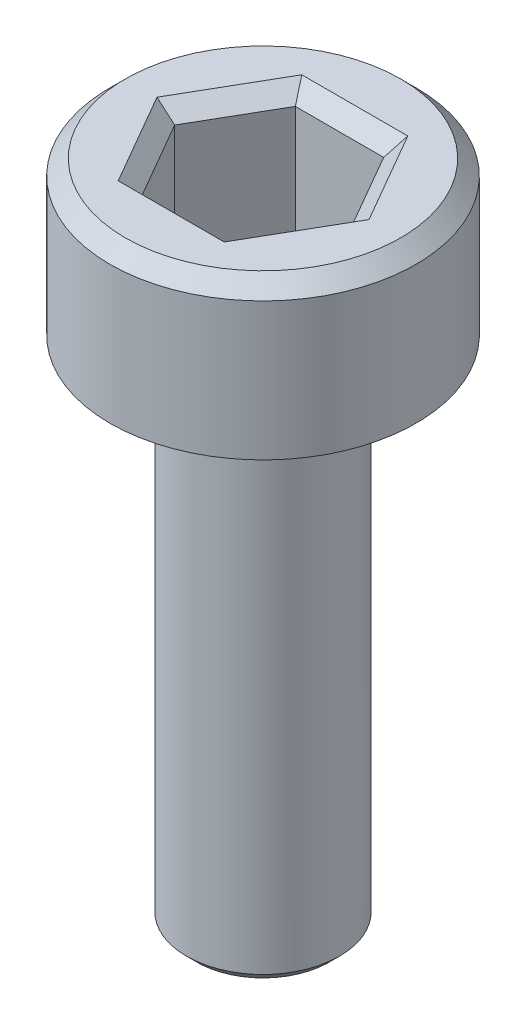
ISO-10303-21;
HEADER;
FILE_DESCRIPTION(('STEP AP214'),'2;1');
FILE_NAME('part.step','',(''),(''),'','','');
FILE_SCHEMA(('AUTOMOTIVE_DESIGN { 1 0 10303 214 1 1 1 1 }'));
ENDSEC;
DATA;
#1=APPLICATION_CONTEXT('core data for automotive mechanical design processes');
#2=APPLICATION_PROTOCOL_DEFINITION('international standard','automotive_design',2000,#1);
#3=PRODUCT_CONTEXT('',#1,'mechanical');
#4=PRODUCT('Part','Part','',(#3));
#5=PRODUCT_RELATED_PRODUCT_CATEGORY('part','',(#4));
#6=PRODUCT_DEFINITION_FORMATION('','',#4);
#7=PRODUCT_DEFINITION_CONTEXT('part definition',#1,'design');
#8=PRODUCT_DEFINITION('design','',#6,#7);
#9=PRODUCT_DEFINITION_SHAPE('','',#8);
#10=(LENGTH_UNIT() NAMED_UNIT(*) SI_UNIT(.MILLI.,.METRE.));
#11=(NAMED_UNIT(*) PLANE_ANGLE_UNIT() SI_UNIT($,.RADIAN.));
#12=(NAMED_UNIT(*) SI_UNIT($,.STERADIAN.) SOLID_ANGLE_UNIT());
#13=UNCERTAINTY_MEASURE_WITH_UNIT(LENGTH_MEASURE(1.E-05),#10,'distance_accuracy_value','');
#14=(GEOMETRIC_REPRESENTATION_CONTEXT(3) GLOBAL_UNCERTAINTY_ASSIGNED_CONTEXT((#13)) GLOBAL_UNIT_ASSIGNED_CONTEXT((#10,
#11,#12)) REPRESENTATION_CONTEXT('',''));
#15=CARTESIAN_POINT('',(0.,0.,0.));
#16=DIRECTION('',(0.,0.,1.));
#17=DIRECTION('',(1.,0.,0.));
#18=AXIS2_PLACEMENT_3D('',#15,#16,#17);
#19=CARTESIAN_POINT('',(0.,0.,0.));
#20=DIRECTION('',(0.,1.,0.));
#21=DIRECTION('',(0.,0.,1.));
#22=AXIS2_PLACEMENT_3D('',#19,#20,#21);
#23=PLANE('',#22);
#24=CARTESIAN_POINT('',(0.,0.,0.));
#25=DIRECTION('',(0.,1.,0.));
#26=DIRECTION('',(0.,0.,1.));
#27=AXIS2_PLACEMENT_3D('',#24,#25,#26);
#28=CIRCLE('',#27,3.);
#29=CARTESIAN_POINT('',(0.,0.,3.));
#30=VERTEX_POINT('',#29);
#31=EDGE_CURVE('E146',#30,#30,#28,.T.);
#32=ORIENTED_EDGE('',*,*,#31,.F.);
#33=EDGE_LOOP('',(#32));
#34=FACE_BOUND('',#33,.T.);
#35=CARTESIAN_POINT('',(0.,0.,0.));
#36=DIRECTION('',(0.,1.,0.));
#37=DIRECTION('',(0.,0.,1.));
#38=AXIS2_PLACEMENT_3D('',#35,#36,#37);
#39=CIRCLE('',#38,1.5);
#40=CARTESIAN_POINT('',(0.,0.,1.5));
#41=VERTEX_POINT('',#40);
#42=EDGE_CURVE('E185',#41,#41,#39,.F.);
#43=ORIENTED_EDGE('',*,*,#42,.F.);
#44=EDGE_LOOP('',(#43));
#45=FACE_BOUND('',#44,.T.);
#46=ADVANCED_FACE('F33',(#34,#45),#23,.F.);
#47=CARTESIAN_POINT('',(0.,3.,0.));
#48=DIRECTION('',(0.,-1.,0.));
#49=DIRECTION('',(0.,0.,-1.));
#50=AXIS2_PLACEMENT_3D('',#47,#48,#49);
#51=CYLINDRICAL_SURFACE('',#50,3.);
#52=CARTESIAN_POINT('',(0.,2.7,0.));
#53=DIRECTION('',(0.,1.,0.));
#54=DIRECTION('',(0.,0.,1.));
#55=AXIS2_PLACEMENT_3D('',#52,#53,#54);
#56=CIRCLE('',#55,3.);
#57=CARTESIAN_POINT('',(0.,2.7,3.));
#58=VERTEX_POINT('',#57);
#59=EDGE_CURVE('E160',#58,#58,#56,.F.);
#60=ORIENTED_EDGE('',*,*,#59,.T.);
#61=EDGE_LOOP('',(#60));
#62=FACE_BOUND('',#61,.T.);
#63=ORIENTED_EDGE('',*,*,#31,.T.);
#64=EDGE_LOOP('',(#63));
#65=FACE_BOUND('',#64,.T.);
#66=ADVANCED_FACE('F213',(#62,#65),#51,.T.);
#67=CARTESIAN_POINT('',(0.,3.,0.));
#68=DIRECTION('',(0.,1.,0.));
#69=DIRECTION('',(0.,0.,1.));
#70=AXIS2_PLACEMENT_3D('',#67,#68,#69);
#71=PLANE('',#70);
#72=DIRECTION('',(1.,0.,0.));
#73=VECTOR('',#72,1.);
#74=CARTESIAN_POINT('',(0.866025403784439,3.,-1.8));
#75=LINE('',#74,#73);
#76=CARTESIAN_POINT('',(-1.03923048454133,3.,-1.8));
#77=VERTEX_POINT('',#76);
#78=CARTESIAN_POINT('',(1.03923048454133,3.,-1.8));
#79=VERTEX_POINT('',#78);
#80=EDGE_CURVE('E165',#77,#79,#75,.T.);
#81=ORIENTED_EDGE('',*,*,#80,.T.);
#82=DIRECTION('',(0.5,0.,0.866025403784439));
#83=VECTOR('',#82,1.);
#84=CARTESIAN_POINT('',(1.99185842870421,3.,-0.150000000000001));
#85=LINE('',#84,#83);
#86=CARTESIAN_POINT('',(2.07846096908265,3.,0.));
#87=VERTEX_POINT('',#86);
#88=EDGE_CURVE('E175',#79,#87,#85,.T.);
#89=ORIENTED_EDGE('',*,*,#88,.T.);
#90=DIRECTION('',(-0.5,0.,0.866025403784439));
#91=VECTOR('',#90,1.);
#92=CARTESIAN_POINT('',(1.12583302491977,3.,1.65));
#93=LINE('',#92,#91);
#94=CARTESIAN_POINT('',(1.03923048454133,3.,1.8));
#95=VERTEX_POINT('',#94);
#96=EDGE_CURVE('E173',#87,#95,#93,.T.);
#97=ORIENTED_EDGE('',*,*,#96,.T.);
#98=DIRECTION('',(-1.,0.,0.));
#99=VECTOR('',#98,1.);
#100=CARTESIAN_POINT('',(-0.866025403784438,3.,1.8));
#101=LINE('',#100,#99);
#102=CARTESIAN_POINT('',(-1.03923048454133,3.,1.8));
#103=VERTEX_POINT('',#102);
#104=EDGE_CURVE('E171',#95,#103,#101,.T.);
#105=ORIENTED_EDGE('',*,*,#104,.T.);
#106=DIRECTION('',(-0.5,0.,-0.866025403784439));
#107=VECTOR('',#106,1.);
#108=CARTESIAN_POINT('',(-1.99185842870421,3.,0.150000000000001));
#109=LINE('',#108,#107);
#110=CARTESIAN_POINT('',(-2.07846096908265,3.,0.));
#111=VERTEX_POINT('',#110);
#112=EDGE_CURVE('E169',#103,#111,#109,.T.);
#113=ORIENTED_EDGE('',*,*,#112,.T.);
#114=DIRECTION('',(0.5,0.,-0.866025403784439));
#115=VECTOR('',#114,1.);
#116=CARTESIAN_POINT('',(-1.12583302491977,3.,-1.65));
#117=LINE('',#116,#115);
#118=EDGE_CURVE('E167',#111,#77,#117,.T.);
#119=ORIENTED_EDGE('',*,*,#118,.T.);
#120=EDGE_LOOP('',(#81,#89,#97,#105,#113,#119));
#121=FACE_BOUND('',#120,.T.);
#122=CARTESIAN_POINT('',(0.,3.,0.));
#123=DIRECTION('',(0.,1.,0.));
#124=DIRECTION('',(0.,0.,1.));
#125=AXIS2_PLACEMENT_3D('',#122,#123,#124);
#126=CIRCLE('',#125,2.7);
#127=CARTESIAN_POINT('',(0.,3.,2.7));
#128=VERTEX_POINT('',#127);
#129=EDGE_CURVE('E157',#128,#128,#126,.T.);
#130=ORIENTED_EDGE('',*,*,#129,.T.);
#131=EDGE_LOOP('',(#130));
#132=FACE_BOUND('',#131,.T.);
#133=ADVANCED_FACE('F219',(#121,#132),#71,.T.);
#134=CARTESIAN_POINT('',(0.,3.,0.));
#135=DIRECTION('',(0.,-1.,0.));
#136=DIRECTION('',(0.,0.,-1.));
#137=AXIS2_PLACEMENT_3D('',#134,#135,#136);
#138=CONICAL_SURFACE('',#137,2.7,0.785398163397448);
#139=ORIENTED_EDGE('',*,*,#59,.F.);
#140=EDGE_LOOP('',(#139));
#141=FACE_BOUND('',#140,.T.);
#142=ORIENTED_EDGE('',*,*,#129,.F.);
#143=EDGE_LOOP('',(#142));
#144=FACE_BOUND('',#143,.T.);
#145=ADVANCED_FACE('F227',(#141,#144),#138,.T.);
#146=CARTESIAN_POINT('',(0.866025403784439,0.5,1.5));
#147=DIRECTION('',(0.866025403784439,0.,0.5));
#148=DIRECTION('',(0.5,0.,-0.866025403784439));
#149=AXIS2_PLACEMENT_3D('',#146,#147,#148);
#150=PLANE('',#149);
#151=DIRECTION('',(0.,1.,0.));
#152=VECTOR('',#151,1.);
#153=CARTESIAN_POINT('',(0.866025403784439,0.5,1.5));
#154=LINE('',#153,#152);
#155=CARTESIAN_POINT('',(0.866025403784439,0.5,1.5));
#156=VERTEX_POINT('',#155);
#157=CARTESIAN_POINT('',(0.866025403784439,2.7,1.5));
#158=VERTEX_POINT('',#157);
#159=EDGE_CURVE('E144',#156,#158,#154,.T.);
#160=ORIENTED_EDGE('',*,*,#159,.T.);
#161=DIRECTION('',(0.5,0.,-0.866025403784439));
#162=VECTOR('',#161,1.);
#163=CARTESIAN_POINT('',(1.73205080756888,2.7,0.));
#164=LINE('',#163,#162);
#165=CARTESIAN_POINT('',(1.73205080756888,2.7,0.));
#166=VERTEX_POINT('',#165);
#167=EDGE_CURVE('E113',#158,#166,#164,.T.);
#168=ORIENTED_EDGE('',*,*,#167,.T.);
#169=DIRECTION('',(0.,1.,0.));
#170=VECTOR('',#169,1.);
#171=CARTESIAN_POINT('',(1.73205080756888,0.5,0.));
#172=LINE('',#171,#170);
#173=CARTESIAN_POINT('',(1.73205080756888,0.5,0.));
#174=VERTEX_POINT('',#173);
#175=EDGE_CURVE('E105',#174,#166,#172,.T.);
#176=ORIENTED_EDGE('',*,*,#175,.F.);
#177=DIRECTION('',(0.5,0.,-0.866025403784439));
#178=VECTOR('',#177,1.);
#179=CARTESIAN_POINT('',(0.866025403784439,0.5,1.5));
#180=LINE('',#179,#178);
#181=EDGE_CURVE('E110',#156,#174,#180,.T.);
#182=ORIENTED_EDGE('',*,*,#181,.F.);
#183=EDGE_LOOP('',(#160,#168,#176,#182));
#184=FACE_BOUND('',#183,.T.);
#185=ADVANCED_FACE('F108',(#184),#150,.F.);
#186=CARTESIAN_POINT('',(-0.866025403784438,0.5,1.5));
#187=DIRECTION('',(0.,0.,1.));
#188=DIRECTION('',(1.,0.,0.));
#189=AXIS2_PLACEMENT_3D('',#186,#187,#188);
#190=PLANE('',#189);
#191=DIRECTION('',(0.,1.,0.));
#192=VECTOR('',#191,1.);
#193=CARTESIAN_POINT('',(-0.866025403784438,0.5,1.5));
#194=LINE('',#193,#192);
#195=CARTESIAN_POINT('',(-0.866025403784438,0.5,1.5));
#196=VERTEX_POINT('',#195);
#197=CARTESIAN_POINT('',(-0.866025403784438,2.7,1.5));
#198=VERTEX_POINT('',#197);
#199=EDGE_CURVE('E147',#196,#198,#194,.T.);
#200=ORIENTED_EDGE('',*,*,#199,.T.);
#201=DIRECTION('',(1.,0.,0.));
#202=VECTOR('',#201,1.);
#203=CARTESIAN_POINT('',(0.866025403784439,2.7,1.5));
#204=LINE('',#203,#202);
#205=EDGE_CURVE('E179',#198,#158,#204,.T.);
#206=ORIENTED_EDGE('',*,*,#205,.T.);
#207=ORIENTED_EDGE('',*,*,#159,.F.);
#208=DIRECTION('',(1.,0.,0.));
#209=VECTOR('',#208,1.);
#210=CARTESIAN_POINT('',(-0.866025403784438,0.5,1.5));
#211=LINE('',#210,#209);
#212=EDGE_CURVE('E118',#196,#156,#211,.T.);
#213=ORIENTED_EDGE('',*,*,#212,.F.);
#214=EDGE_LOOP('',(#200,#206,#207,#213));
#215=FACE_BOUND('',#214,.T.);
#216=ADVANCED_FACE('F280',(#215),#190,.F.);
#217=CARTESIAN_POINT('',(-1.73205080756888,0.5,0.));
#218=DIRECTION('',(-0.866025403784438,0.,0.5));
#219=DIRECTION('',(0.5,0.,0.866025403784439));
#220=AXIS2_PLACEMENT_3D('',#217,#218,#219);
#221=PLANE('',#220);
#222=DIRECTION('',(0.,1.,0.));
#223=VECTOR('',#222,1.);
#224=CARTESIAN_POINT('',(-1.73205080756888,0.5,0.));
#225=LINE('',#224,#223);
#226=CARTESIAN_POINT('',(-1.73205080756888,0.5,0.));
#227=VERTEX_POINT('',#226);
#228=CARTESIAN_POINT('',(-1.73205080756888,2.7,0.));
#229=VERTEX_POINT('',#228);
#230=EDGE_CURVE('E150',#227,#229,#225,.T.);
#231=ORIENTED_EDGE('',*,*,#230,.T.);
#232=DIRECTION('',(0.5,0.,0.866025403784439));
#233=VECTOR('',#232,1.);
#234=CARTESIAN_POINT('',(-0.866025403784438,2.7,1.5));
#235=LINE('',#234,#233);
#236=EDGE_CURVE('E181',#229,#198,#235,.T.);
#237=ORIENTED_EDGE('',*,*,#236,.T.);
#238=ORIENTED_EDGE('',*,*,#199,.F.);
#239=DIRECTION('',(0.5,0.,0.866025403784439));
#240=VECTOR('',#239,1.);
#241=CARTESIAN_POINT('',(-1.73205080756888,0.5,0.));
#242=LINE('',#241,#240);
#243=EDGE_CURVE('E141',#227,#196,#242,.T.);
#244=ORIENTED_EDGE('',*,*,#243,.F.);
#245=EDGE_LOOP('',(#231,#237,#238,#244));
#246=FACE_BOUND('',#245,.T.);
#247=ADVANCED_FACE('F278',(#246),#221,.F.);
#248=CARTESIAN_POINT('',(-0.866025403784438,0.5,-1.5));
#249=DIRECTION('',(-0.866025403784439,0.,-0.5));
#250=DIRECTION('',(-0.5,0.,0.866025403784439));
#251=AXIS2_PLACEMENT_3D('',#248,#249,#250);
#252=PLANE('',#251);
#253=DIRECTION('',(0.,1.,0.));
#254=VECTOR('',#253,1.);
#255=CARTESIAN_POINT('',(-0.866025403784438,0.5,-1.5));
#256=LINE('',#255,#254);
#257=CARTESIAN_POINT('',(-0.866025403784438,0.5,-1.5));
#258=VERTEX_POINT('',#257);
#259=CARTESIAN_POINT('',(-0.866025403784438,2.7,-1.5));
#260=VERTEX_POINT('',#259);
#261=EDGE_CURVE('E152',#258,#260,#256,.T.);
#262=ORIENTED_EDGE('',*,*,#261,.T.);
#263=DIRECTION('',(-0.5,0.,0.866025403784439));
#264=VECTOR('',#263,1.);
#265=CARTESIAN_POINT('',(-1.73205080756888,2.7,0.));
#266=LINE('',#265,#264);
#267=EDGE_CURVE('E55',#260,#229,#266,.T.);
#268=ORIENTED_EDGE('',*,*,#267,.T.);
#269=ORIENTED_EDGE('',*,*,#230,.F.);
#270=DIRECTION('',(-0.5,0.,0.866025403784439));
#271=VECTOR('',#270,1.);
#272=CARTESIAN_POINT('',(-0.866025403784438,0.5,-1.5));
#273=LINE('',#272,#271);
#274=EDGE_CURVE('E138',#258,#227,#273,.T.);
#275=ORIENTED_EDGE('',*,*,#274,.F.);
#276=EDGE_LOOP('',(#262,#268,#269,#275));
#277=FACE_BOUND('',#276,.T.);
#278=ADVANCED_FACE('F276',(#277),#252,.F.);
#279=CARTESIAN_POINT('',(0.866025403784439,0.5,-1.5));
#280=DIRECTION('',(0.,0.,-1.));
#281=DIRECTION('',(-1.,0.,0.));
#282=AXIS2_PLACEMENT_3D('',#279,#280,#281);
#283=PLANE('',#282);
#284=DIRECTION('',(0.,1.,0.));
#285=VECTOR('',#284,1.);
#286=CARTESIAN_POINT('',(0.866025403784439,0.5,-1.5));
#287=LINE('',#286,#285);
#288=CARTESIAN_POINT('',(0.866025403784439,0.5,-1.5));
#289=VERTEX_POINT('',#288);
#290=CARTESIAN_POINT('',(0.866025403784439,2.7,-1.5));
#291=VERTEX_POINT('',#290);
#292=EDGE_CURVE('E117',#289,#291,#287,.T.);
#293=ORIENTED_EDGE('',*,*,#292,.T.);
#294=DIRECTION('',(-1.,0.,0.));
#295=VECTOR('',#294,1.);
#296=CARTESIAN_POINT('',(-0.866025403784438,2.7,-1.5));
#297=LINE('',#296,#295);
#298=EDGE_CURVE('E48',#291,#260,#297,.T.);
#299=ORIENTED_EDGE('',*,*,#298,.T.);
#300=ORIENTED_EDGE('',*,*,#261,.F.);
#301=DIRECTION('',(-1.,0.,0.));
#302=VECTOR('',#301,1.);
#303=CARTESIAN_POINT('',(0.866025403784439,0.5,-1.5));
#304=LINE('',#303,#302);
#305=EDGE_CURVE('E126',#289,#258,#304,.T.);
#306=ORIENTED_EDGE('',*,*,#305,.F.);
#307=EDGE_LOOP('',(#293,#299,#300,#306));
#308=FACE_BOUND('',#307,.T.);
#309=ADVANCED_FACE('F273',(#308),#283,.F.);
#310=CARTESIAN_POINT('',(1.73205080756888,0.5,0.));
#311=DIRECTION('',(0.866025403784438,0.,-0.5));
#312=DIRECTION('',(-0.5,0.,-0.866025403784438));
#313=AXIS2_PLACEMENT_3D('',#310,#311,#312);
#314=PLANE('',#313);
#315=ORIENTED_EDGE('',*,*,#175,.T.);
#316=DIRECTION('',(-0.5,0.,-0.866025403784438));
#317=VECTOR('',#316,1.);
#318=CARTESIAN_POINT('',(0.866025403784439,2.7,-1.5));
#319=LINE('',#318,#317);
#320=EDGE_CURVE('E163',#166,#291,#319,.T.);
#321=ORIENTED_EDGE('',*,*,#320,.T.);
#322=ORIENTED_EDGE('',*,*,#292,.F.);
#323=DIRECTION('',(-0.5,0.,-0.866025403784438));
#324=VECTOR('',#323,1.);
#325=CARTESIAN_POINT('',(1.73205080756888,0.5,0.));
#326=LINE('',#325,#324);
#327=EDGE_CURVE('E121',#174,#289,#326,.T.);
#328=ORIENTED_EDGE('',*,*,#327,.F.);
#329=EDGE_LOOP('',(#315,#321,#322,#328));
#330=FACE_BOUND('',#329,.T.);
#331=ADVANCED_FACE('F122',(#330),#314,.F.);
#332=CARTESIAN_POINT('',(0.,0.5,0.));
#333=DIRECTION('',(0.,1.,0.));
#334=DIRECTION('',(0.,0.,1.));
#335=AXIS2_PLACEMENT_3D('',#332,#333,#334);
#336=PLANE('',#335);
#337=ORIENTED_EDGE('',*,*,#181,.T.);
#338=ORIENTED_EDGE('',*,*,#327,.T.);
#339=ORIENTED_EDGE('',*,*,#305,.T.);
#340=ORIENTED_EDGE('',*,*,#274,.T.);
#341=ORIENTED_EDGE('',*,*,#243,.T.);
#342=ORIENTED_EDGE('',*,*,#212,.T.);
#343=EDGE_LOOP('',(#337,#338,#339,#340,#341,#342));
#344=FACE_BOUND('',#343,.T.);
#345=ADVANCED_FACE('F128',(#344),#336,.T.);
#346=CARTESIAN_POINT('',(-1.73205080756888,2.7,0.));
#347=DIRECTION('',(0.612372435695794,0.707106781186548,-0.353553390593273));
#348=DIRECTION('',(-0.5,0.,-0.866025403784439));
#349=AXIS2_PLACEMENT_3D('',#346,#347,#348);
#350=PLANE('',#349);
#351=DIRECTION('',(0.755928946018455,-0.654653670707976,0.));
#352=VECTOR('',#351,1.);
#353=CARTESIAN_POINT('',(-1.73205080756888,2.7,0.));
#354=LINE('',#353,#352);
#355=EDGE_CURVE('E134',#111,#229,#354,.T.);
#356=ORIENTED_EDGE('',*,*,#355,.F.);
#357=ORIENTED_EDGE('',*,*,#112,.F.);
#358=DIRECTION('',(0.377964473009228,-0.654653670707976,-0.654653670707978));
#359=VECTOR('',#358,1.);
#360=CARTESIAN_POINT('',(-0.866025403784438,2.7,1.5));
#361=LINE('',#360,#359);
#362=EDGE_CURVE('E131',#198,#103,#361,.F.);
#363=ORIENTED_EDGE('',*,*,#362,.F.);
#364=ORIENTED_EDGE('',*,*,#236,.F.);
#365=EDGE_LOOP('',(#356,#357,#363,#364));
#366=FACE_BOUND('',#365,.T.);
#367=ADVANCED_FACE('F249',(#366),#350,.T.);
#368=CARTESIAN_POINT('',(-0.866025403784438,2.7,1.5));
#369=DIRECTION('',(0.,0.707106781186548,-0.707106781186547));
#370=DIRECTION('',(-1.,0.,0.));
#371=AXIS2_PLACEMENT_3D('',#368,#369,#370);
#372=PLANE('',#371);
#373=ORIENTED_EDGE('',*,*,#362,.T.);
#374=ORIENTED_EDGE('',*,*,#104,.F.);
#375=DIRECTION('',(-0.377964473009228,-0.654653670707976,-0.654653670707978));
#376=VECTOR('',#375,1.);
#377=CARTESIAN_POINT('',(0.866025403784439,2.7,1.5));
#378=LINE('',#377,#376);
#379=EDGE_CURVE('E193',#158,#95,#378,.F.);
#380=ORIENTED_EDGE('',*,*,#379,.F.);
#381=ORIENTED_EDGE('',*,*,#205,.F.);
#382=EDGE_LOOP('',(#373,#374,#380,#381));
#383=FACE_BOUND('',#382,.T.);
#384=ADVANCED_FACE('F246',(#383),#372,.T.);
#385=CARTESIAN_POINT('',(-0.866025403784438,2.7,-1.5));
#386=DIRECTION('',(0.612372435695794,0.707106781186549,0.353553390593273));
#387=DIRECTION('',(0.5,0.,-0.866025403784439));
#388=AXIS2_PLACEMENT_3D('',#385,#386,#387);
#389=PLANE('',#388);
#390=ORIENTED_EDGE('',*,*,#355,.T.);
#391=ORIENTED_EDGE('',*,*,#267,.F.);
#392=DIRECTION('',(0.377964473009228,-0.654653670707976,0.654653670707978));
#393=VECTOR('',#392,1.);
#394=CARTESIAN_POINT('',(-0.866025403784438,2.7,-1.5));
#395=LINE('',#394,#393);
#396=EDGE_CURVE('E190',#77,#260,#395,.T.);
#397=ORIENTED_EDGE('',*,*,#396,.F.);
#398=ORIENTED_EDGE('',*,*,#118,.F.);
#399=EDGE_LOOP('',(#390,#391,#397,#398));
#400=FACE_BOUND('',#399,.T.);
#401=ADVANCED_FACE('F242',(#400),#389,.T.);
#402=CARTESIAN_POINT('',(0.866025403784439,2.7,1.5));
#403=DIRECTION('',(-0.612372435695794,0.707106781186549,-0.353553390593273));
#404=DIRECTION('',(-0.5,0.,0.866025403784439));
#405=AXIS2_PLACEMENT_3D('',#402,#403,#404);
#406=PLANE('',#405);
#407=ORIENTED_EDGE('',*,*,#379,.T.);
#408=ORIENTED_EDGE('',*,*,#96,.F.);
#409=DIRECTION('',(-0.755928946018455,-0.654653670707976,0.));
#410=VECTOR('',#409,1.);
#411=CARTESIAN_POINT('',(1.73205080756888,2.7,0.));
#412=LINE('',#411,#410);
#413=EDGE_CURVE('E188',#166,#87,#412,.F.);
#414=ORIENTED_EDGE('',*,*,#413,.F.);
#415=ORIENTED_EDGE('',*,*,#167,.F.);
#416=EDGE_LOOP('',(#407,#408,#414,#415));
#417=FACE_BOUND('',#416,.T.);
#418=ADVANCED_FACE('F238',(#417),#406,.T.);
#419=CARTESIAN_POINT('',(0.866025403784439,2.7,-1.5));
#420=DIRECTION('',(0.,0.707106781186549,0.707106781186547));
#421=DIRECTION('',(1.,0.,0.));
#422=AXIS2_PLACEMENT_3D('',#419,#420,#421);
#423=PLANE('',#422);
#424=ORIENTED_EDGE('',*,*,#396,.T.);
#425=ORIENTED_EDGE('',*,*,#298,.F.);
#426=DIRECTION('',(0.377964473009228,0.654653670707976,-0.654653670707978));
#427=VECTOR('',#426,1.);
#428=CARTESIAN_POINT('',(0.618589574131741,2.27142857142857,-1.07142857142857));
#429=LINE('',#428,#427);
#430=EDGE_CURVE('E186',#79,#291,#429,.F.);
#431=ORIENTED_EDGE('',*,*,#430,.F.);
#432=ORIENTED_EDGE('',*,*,#80,.F.);
#433=EDGE_LOOP('',(#424,#425,#431,#432));
#434=FACE_BOUND('',#433,.T.);
#435=ADVANCED_FACE('F234',(#434),#423,.T.);
#436=CARTESIAN_POINT('',(1.73205080756888,2.7,0.));
#437=DIRECTION('',(-0.612372435695793,0.707106781186549,0.353553390593273));
#438=DIRECTION('',(0.5,0.,0.866025403784438));
#439=AXIS2_PLACEMENT_3D('',#436,#437,#438);
#440=PLANE('',#439);
#441=ORIENTED_EDGE('',*,*,#413,.T.);
#442=ORIENTED_EDGE('',*,*,#88,.F.);
#443=ORIENTED_EDGE('',*,*,#430,.T.);
#444=ORIENTED_EDGE('',*,*,#320,.F.);
#445=EDGE_LOOP('',(#441,#442,#443,#444));
#446=FACE_BOUND('',#445,.T.);
#447=ADVANCED_FACE('F231',(#446),#440,.T.);
#448=CARTESIAN_POINT('',(0.,-10.,0.));
#449=DIRECTION('',(0.,1.,0.));
#450=DIRECTION('',(0.,0.,1.));
#451=AXIS2_PLACEMENT_3D('',#448,#449,#450);
#452=CYLINDRICAL_SURFACE('',#451,1.5);
#453=CARTESIAN_POINT('',(0.,-9.8,0.));
#454=DIRECTION('',(0.,-1.,0.));
#455=DIRECTION('',(0.,0.,-1.));
#456=AXIS2_PLACEMENT_3D('',#453,#454,#455);
#457=CIRCLE('',#456,1.5);
#458=CARTESIAN_POINT('',(0.,-9.8,-1.5));
#459=VERTEX_POINT('',#458);
#460=EDGE_CURVE('E11',#459,#459,#457,.F.);
#461=ORIENTED_EDGE('',*,*,#460,.T.);
#462=EDGE_LOOP('',(#461));
#463=FACE_BOUND('',#462,.T.);
#464=ORIENTED_EDGE('',*,*,#42,.T.);
#465=EDGE_LOOP('',(#464));
#466=FACE_BOUND('',#465,.T.);
#467=ADVANCED_FACE('F209',(#463,#466),#452,.T.);
#468=CARTESIAN_POINT('',(0.,-10.,0.));
#469=DIRECTION('',(0.,-1.,0.));
#470=DIRECTION('',(0.,0.,-1.));
#471=AXIS2_PLACEMENT_3D('',#468,#469,#470);
#472=PLANE('',#471);
#473=CARTESIAN_POINT('',(0.,-10.,0.));
#474=DIRECTION('',(0.,-1.,0.));
#475=DIRECTION('',(0.,0.,-1.));
#476=AXIS2_PLACEMENT_3D('',#473,#474,#475);
#477=CIRCLE('',#476,1.3);
#478=CARTESIAN_POINT('',(0.,-10.,-1.3));
#479=VERTEX_POINT('',#478);
#480=EDGE_CURVE('E41',#479,#479,#477,.T.);
#481=ORIENTED_EDGE('',*,*,#480,.T.);
#482=EDGE_LOOP('',(#481));
#483=FACE_BOUND('',#482,.T.);
#484=ADVANCED_FACE('F202',(#483),#472,.T.);
#485=CARTESIAN_POINT('',(0.,-10.,0.));
#486=DIRECTION('',(0.,1.,0.));
#487=DIRECTION('',(0.,0.,1.));
#488=AXIS2_PLACEMENT_3D('',#485,#486,#487);
#489=CONICAL_SURFACE('',#488,1.3,0.78539816339745);
#490=ORIENTED_EDGE('',*,*,#460,.F.);
#491=EDGE_LOOP('',(#490));
#492=FACE_BOUND('',#491,.T.);
#493=ORIENTED_EDGE('',*,*,#480,.F.);
#494=EDGE_LOOP('',(#493));
#495=FACE_BOUND('',#494,.T.);
#496=ADVANCED_FACE('F35',(#492,#495),#489,.T.);
#497=CLOSED_SHELL('',(#46,#66,#133,#145,#185,#216,#247,#278,#309,#331,#345,#367,#384,#401,#418,
#435,#447,#467,#484,#496));
#498=MANIFOLD_SOLID_BREP('B2',#497);
#499=ADVANCED_BREP_SHAPE_REPRESENTATION('',(#18,#498),#14);
#500=SHAPE_DEFINITION_REPRESENTATION(#9,#499);
ENDSEC;
END-ISO-10303-21;
